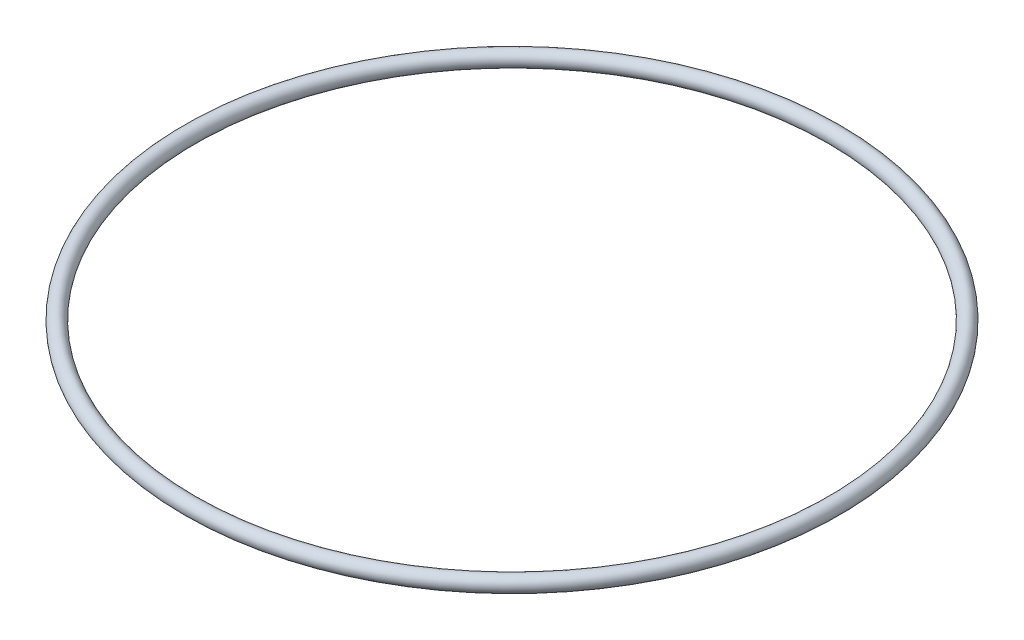
ISO-10303-21;
HEADER;
FILE_DESCRIPTION(('STEP AP214'),'2;1');
FILE_NAME('part.step','',(''),(''),'','','');
FILE_SCHEMA(('AUTOMOTIVE_DESIGN { 1 0 10303 214 1 1 1 1 }'));
ENDSEC;
DATA;
#1=APPLICATION_CONTEXT('core data for automotive mechanical design processes');
#2=APPLICATION_PROTOCOL_DEFINITION('international standard','automotive_design',2000,#1);
#3=PRODUCT_CONTEXT('',#1,'mechanical');
#4=PRODUCT('Part','Part','',(#3));
#5=PRODUCT_RELATED_PRODUCT_CATEGORY('part','',(#4));
#6=PRODUCT_DEFINITION_FORMATION('','',#4);
#7=PRODUCT_DEFINITION_CONTEXT('part definition',#1,'design');
#8=PRODUCT_DEFINITION('design','',#6,#7);
#9=PRODUCT_DEFINITION_SHAPE('','',#8);
#10=(LENGTH_UNIT() NAMED_UNIT(*) SI_UNIT(.MILLI.,.METRE.));
#11=(NAMED_UNIT(*) PLANE_ANGLE_UNIT() SI_UNIT($,.RADIAN.));
#12=(NAMED_UNIT(*) SI_UNIT($,.STERADIAN.) SOLID_ANGLE_UNIT());
#13=UNCERTAINTY_MEASURE_WITH_UNIT(LENGTH_MEASURE(1.E-05),#10,'distance_accuracy_value','');
#14=(GEOMETRIC_REPRESENTATION_CONTEXT(3) GLOBAL_UNCERTAINTY_ASSIGNED_CONTEXT((#13)) GLOBAL_UNIT_ASSIGNED_CONTEXT((#10,
#11,#12)) REPRESENTATION_CONTEXT('',''));
#15=CARTESIAN_POINT('',(0.,0.,0.));
#16=DIRECTION('',(0.,0.,1.));
#17=DIRECTION('',(1.,0.,0.));
#18=AXIS2_PLACEMENT_3D('',#15,#16,#17);
#19=CARTESIAN_POINT('',(0.,0.,0.));
#20=DIRECTION('',(0.,1.,0.));
#21=DIRECTION('',(0.,0.,1.));
#22=AXIS2_PLACEMENT_3D('',#19,#20,#21);
#23=TOROIDAL_SURFACE('',#22,21.,0.499999999999999);
#24=CARTESIAN_POINT('',(0.,0.,21.5));
#25=VERTEX_POINT('',#24);
#26=VERTEX_LOOP('',#25);
#27=FACE_BOUND('',#26,.T.);
#28=ADVANCED_FACE('F32',(#27),#23,.T.);
#29=CLOSED_SHELL('',(#28));
#30=MANIFOLD_SOLID_BREP('B2',#29);
#31=ADVANCED_BREP_SHAPE_REPRESENTATION('',(#18,#30),#14);
#32=SHAPE_DEFINITION_REPRESENTATION(#9,#31);
ENDSEC;
END-ISO-10303-21;
